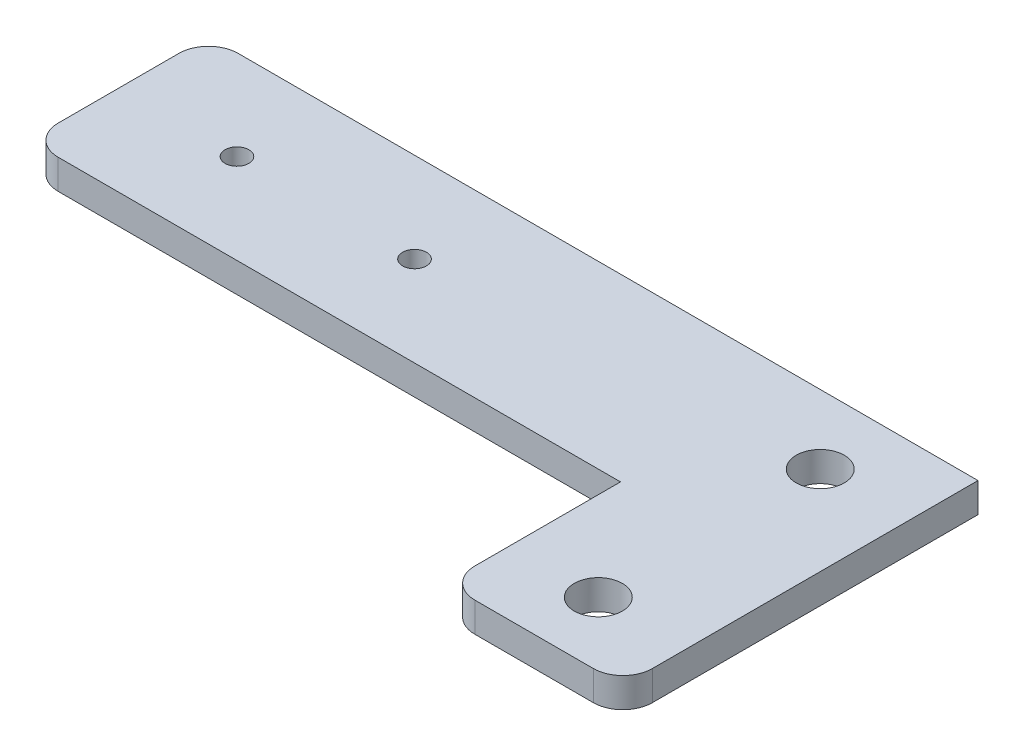
ISO-10303-21;
HEADER;
FILE_DESCRIPTION(('STEP AP214'),'2;1');
FILE_NAME('part.step','',(''),(''),'','','');
FILE_SCHEMA(('AUTOMOTIVE_DESIGN { 1 0 10303 214 1 1 1 1 }'));
ENDSEC;
DATA;
#1=APPLICATION_CONTEXT('core data for automotive mechanical design processes');
#2=APPLICATION_PROTOCOL_DEFINITION('international standard','automotive_design',2000,#1);
#3=PRODUCT_CONTEXT('',#1,'mechanical');
#4=PRODUCT('Part','Part','',(#3));
#5=PRODUCT_RELATED_PRODUCT_CATEGORY('part','',(#4));
#6=PRODUCT_DEFINITION_FORMATION('','',#4);
#7=PRODUCT_DEFINITION_CONTEXT('part definition',#1,'design');
#8=PRODUCT_DEFINITION('design','',#6,#7);
#9=PRODUCT_DEFINITION_SHAPE('','',#8);
#10=(LENGTH_UNIT() NAMED_UNIT(*) SI_UNIT(.MILLI.,.METRE.));
#11=(NAMED_UNIT(*) PLANE_ANGLE_UNIT() SI_UNIT($,.RADIAN.));
#12=(NAMED_UNIT(*) SI_UNIT($,.STERADIAN.) SOLID_ANGLE_UNIT());
#13=UNCERTAINTY_MEASURE_WITH_UNIT(LENGTH_MEASURE(1.E-05),#10,'distance_accuracy_value','');
#14=(GEOMETRIC_REPRESENTATION_CONTEXT(3) GLOBAL_UNCERTAINTY_ASSIGNED_CONTEXT((#13)) GLOBAL_UNIT_ASSIGNED_CONTEXT((#10,
#11,#12)) REPRESENTATION_CONTEXT('',''));
#15=CARTESIAN_POINT('',(0.,0.,0.));
#16=DIRECTION('',(0.,0.,1.));
#17=DIRECTION('',(1.,0.,0.));
#18=AXIS2_PLACEMENT_3D('',#15,#16,#17);
#19=CARTESIAN_POINT('',(0.,6.35,38.608));
#20=DIRECTION('',(1.,0.,0.));
#21=DIRECTION('',(0.,0.,-1.));
#22=AXIS2_PLACEMENT_3D('',#19,#20,#21);
#23=PLANE('',#22);
#24=DIRECTION('',(0.,0.,1.));
#25=VECTOR('',#24,1.);
#26=CARTESIAN_POINT('',(0.,0.,38.608));
#27=LINE('',#26,#25);
#28=CARTESIAN_POINT('',(0.,0.,6.35));
#29=VERTEX_POINT('',#28);
#30=CARTESIAN_POINT('',(0.,0.,32.258));
#31=VERTEX_POINT('',#30);
#32=EDGE_CURVE('E157',#29,#31,#27,.T.);
#33=ORIENTED_EDGE('',*,*,#32,.T.);
#34=DIRECTION('',(0.,-1.,0.));
#35=VECTOR('',#34,1.);
#36=CARTESIAN_POINT('',(0.,6.35,32.258));
#37=LINE('',#36,#35);
#38=CARTESIAN_POINT('',(0.,6.35,32.258));
#39=VERTEX_POINT('',#38);
#40=EDGE_CURVE('E48',#31,#39,#37,.F.);
#41=ORIENTED_EDGE('',*,*,#40,.T.);
#42=DIRECTION('',(0.,0.,1.));
#43=VECTOR('',#42,1.);
#44=CARTESIAN_POINT('',(0.,6.35,38.608));
#45=LINE('',#44,#43);
#46=CARTESIAN_POINT('',(0.,6.35,6.35));
#47=VERTEX_POINT('',#46);
#48=EDGE_CURVE('E131',#47,#39,#45,.T.);
#49=ORIENTED_EDGE('',*,*,#48,.F.);
#50=DIRECTION('',(0.,-1.,0.));
#51=VECTOR('',#50,1.);
#52=CARTESIAN_POINT('',(0.,6.35,6.35));
#53=LINE('',#52,#51);
#54=EDGE_CURVE('E218',#47,#29,#53,.T.);
#55=ORIENTED_EDGE('',*,*,#54,.T.);
#56=EDGE_LOOP('',(#33,#41,#49,#55));
#57=FACE_BOUND('',#56,.T.);
#58=ADVANCED_FACE('F39',(#57),#23,.F.);
#59=CARTESIAN_POINT('',(127.,6.35,38.608));
#60=DIRECTION('',(0.,0.,-1.));
#61=DIRECTION('',(-1.,0.,0.));
#62=AXIS2_PLACEMENT_3D('',#59,#60,#61);
#63=PLANE('',#62);
#64=DIRECTION('',(1.,0.,0.));
#65=VECTOR('',#64,1.);
#66=CARTESIAN_POINT('',(127.,6.35,38.608));
#67=LINE('',#66,#65);
#68=CARTESIAN_POINT('',(6.34999999999999,6.35,38.608));
#69=VERTEX_POINT('',#68);
#70=CARTESIAN_POINT('',(127.,6.35,38.608));
#71=VERTEX_POINT('',#70);
#72=EDGE_CURVE('E118',#69,#71,#67,.T.);
#73=ORIENTED_EDGE('',*,*,#72,.F.);
#74=DIRECTION('',(0.,-1.,0.));
#75=VECTOR('',#74,1.);
#76=CARTESIAN_POINT('',(6.34999999999999,6.35,38.608));
#77=LINE('',#76,#75);
#78=CARTESIAN_POINT('',(6.34999999999999,0.,38.608));
#79=VERTEX_POINT('',#78);
#80=EDGE_CURVE('E215',#69,#79,#77,.T.);
#81=ORIENTED_EDGE('',*,*,#80,.T.);
#82=DIRECTION('',(1.,0.,0.));
#83=VECTOR('',#82,1.);
#84=CARTESIAN_POINT('',(127.,0.,38.608));
#85=LINE('',#84,#83);
#86=CARTESIAN_POINT('',(127.,0.,38.608));
#87=VERTEX_POINT('',#86);
#88=EDGE_CURVE('E137',#79,#87,#85,.T.);
#89=ORIENTED_EDGE('',*,*,#88,.T.);
#90=DIRECTION('',(0.,-1.,0.));
#91=VECTOR('',#90,1.);
#92=CARTESIAN_POINT('',(127.,6.35,38.608));
#93=LINE('',#92,#91);
#94=EDGE_CURVE('E134',#71,#87,#93,.T.);
#95=ORIENTED_EDGE('',*,*,#94,.F.);
#96=EDGE_LOOP('',(#73,#81,#89,#95));
#97=FACE_BOUND('',#96,.T.);
#98=ADVANCED_FACE('F135',(#97),#63,.F.);
#99=CARTESIAN_POINT('',(127.,6.35,76.2));
#100=DIRECTION('',(1.,0.,0.));
#101=DIRECTION('',(0.,0.,-1.));
#102=AXIS2_PLACEMENT_3D('',#99,#100,#101);
#103=PLANE('',#102);
#104=DIRECTION('',(0.,0.,1.));
#105=VECTOR('',#104,1.);
#106=CARTESIAN_POINT('',(127.,0.,76.2));
#107=LINE('',#106,#105);
#108=CARTESIAN_POINT('',(127.,0.,69.85));
#109=VERTEX_POINT('',#108);
#110=EDGE_CURVE('E164',#87,#109,#107,.T.);
#111=ORIENTED_EDGE('',*,*,#110,.T.);
#112=DIRECTION('',(0.,-1.,0.));
#113=VECTOR('',#112,1.);
#114=CARTESIAN_POINT('',(127.,6.35,69.85));
#115=LINE('',#114,#113);
#116=CARTESIAN_POINT('',(127.,6.35,69.85));
#117=VERTEX_POINT('',#116);
#118=EDGE_CURVE('E61',#109,#117,#115,.F.);
#119=ORIENTED_EDGE('',*,*,#118,.T.);
#120=DIRECTION('',(0.,0.,1.));
#121=VECTOR('',#120,1.);
#122=CARTESIAN_POINT('',(127.,6.35,76.2));
#123=LINE('',#122,#121);
#124=EDGE_CURVE('E122',#71,#117,#123,.T.);
#125=ORIENTED_EDGE('',*,*,#124,.F.);
#126=ORIENTED_EDGE('',*,*,#94,.T.);
#127=EDGE_LOOP('',(#111,#119,#125,#126));
#128=FACE_BOUND('',#127,.T.);
#129=ADVANCED_FACE('F143',(#128),#103,.F.);
#130=CARTESIAN_POINT('',(165.1,6.35,76.2));
#131=DIRECTION('',(0.,0.,-1.));
#132=DIRECTION('',(-1.,0.,0.));
#133=AXIS2_PLACEMENT_3D('',#130,#131,#132);
#134=PLANE('',#133);
#135=DIRECTION('',(1.,0.,0.));
#136=VECTOR('',#135,1.);
#137=CARTESIAN_POINT('',(165.1,0.,76.2));
#138=LINE('',#137,#136);
#139=CARTESIAN_POINT('',(133.35,0.,76.2));
#140=VERTEX_POINT('',#139);
#141=CARTESIAN_POINT('',(158.75,0.,76.2));
#142=VERTEX_POINT('',#141);
#143=EDGE_CURVE('E167',#140,#142,#138,.T.);
#144=ORIENTED_EDGE('',*,*,#143,.T.);
#145=DIRECTION('',(0.,-1.,0.));
#146=VECTOR('',#145,1.);
#147=CARTESIAN_POINT('',(158.75,6.35,76.2));
#148=LINE('',#147,#146);
#149=CARTESIAN_POINT('',(158.75,6.35,76.2));
#150=VERTEX_POINT('',#149);
#151=EDGE_CURVE('E199',#142,#150,#148,.F.);
#152=ORIENTED_EDGE('',*,*,#151,.T.);
#153=DIRECTION('',(1.,0.,0.));
#154=VECTOR('',#153,1.);
#155=CARTESIAN_POINT('',(165.1,6.35,76.2));
#156=LINE('',#155,#154);
#157=CARTESIAN_POINT('',(133.35,6.35,76.2));
#158=VERTEX_POINT('',#157);
#159=EDGE_CURVE('E145',#158,#150,#156,.T.);
#160=ORIENTED_EDGE('',*,*,#159,.F.);
#161=DIRECTION('',(0.,-1.,0.));
#162=VECTOR('',#161,1.);
#163=CARTESIAN_POINT('',(133.35,6.35,76.2));
#164=LINE('',#163,#162);
#165=EDGE_CURVE('E195',#158,#140,#164,.T.);
#166=ORIENTED_EDGE('',*,*,#165,.T.);
#167=EDGE_LOOP('',(#144,#152,#160,#166));
#168=FACE_BOUND('',#167,.T.);
#169=ADVANCED_FACE('F241',(#168),#134,.F.);
#170=CARTESIAN_POINT('',(165.1,6.35,0.));
#171=DIRECTION('',(-1.,0.,0.));
#172=DIRECTION('',(0.,0.,1.));
#173=AXIS2_PLACEMENT_3D('',#170,#171,#172);
#174=PLANE('',#173);
#175=DIRECTION('',(0.,0.,-1.));
#176=VECTOR('',#175,1.);
#177=CARTESIAN_POINT('',(165.1,6.35,0.));
#178=LINE('',#177,#176);
#179=CARTESIAN_POINT('',(165.1,6.35,69.85));
#180=VERTEX_POINT('',#179);
#181=CARTESIAN_POINT('',(165.1,6.35,0.));
#182=VERTEX_POINT('',#181);
#183=EDGE_CURVE('E148',#180,#182,#178,.T.);
#184=ORIENTED_EDGE('',*,*,#183,.F.);
#185=DIRECTION('',(0.,-1.,0.));
#186=VECTOR('',#185,1.);
#187=CARTESIAN_POINT('',(165.1,6.35,69.85));
#188=LINE('',#187,#186);
#189=CARTESIAN_POINT('',(165.1,0.,69.85));
#190=VERTEX_POINT('',#189);
#191=EDGE_CURVE('E140',#180,#190,#188,.T.);
#192=ORIENTED_EDGE('',*,*,#191,.T.);
#193=DIRECTION('',(0.,0.,-1.));
#194=VECTOR('',#193,1.);
#195=CARTESIAN_POINT('',(165.1,0.,0.));
#196=LINE('',#195,#194);
#197=CARTESIAN_POINT('',(165.1,0.,0.));
#198=VERTEX_POINT('',#197);
#199=EDGE_CURVE('E171',#190,#198,#196,.T.);
#200=ORIENTED_EDGE('',*,*,#199,.T.);
#201=DIRECTION('',(0.,-1.,0.));
#202=VECTOR('',#201,1.);
#203=CARTESIAN_POINT('',(165.1,6.35,0.));
#204=LINE('',#203,#202);
#205=EDGE_CURVE('E141',#182,#198,#204,.T.);
#206=ORIENTED_EDGE('',*,*,#205,.F.);
#207=EDGE_LOOP('',(#184,#192,#200,#206));
#208=FACE_BOUND('',#207,.T.);
#209=ADVANCED_FACE('F249',(#208),#174,.F.);
#210=CARTESIAN_POINT('',(0.,6.35,0.));
#211=DIRECTION('',(0.,0.,1.));
#212=DIRECTION('',(1.,0.,0.));
#213=AXIS2_PLACEMENT_3D('',#210,#211,#212);
#214=PLANE('',#213);
#215=DIRECTION('',(-1.,0.,0.));
#216=VECTOR('',#215,1.);
#217=CARTESIAN_POINT('',(0.,0.,0.));
#218=LINE('',#217,#216);
#219=CARTESIAN_POINT('',(6.35,0.,0.));
#220=VERTEX_POINT('',#219);
#221=EDGE_CURVE('E174',#198,#220,#218,.T.);
#222=ORIENTED_EDGE('',*,*,#221,.T.);
#223=DIRECTION('',(0.,-1.,0.));
#224=VECTOR('',#223,1.);
#225=CARTESIAN_POINT('',(6.35,6.35,0.));
#226=LINE('',#225,#224);
#227=CARTESIAN_POINT('',(6.35,6.35,0.));
#228=VERTEX_POINT('',#227);
#229=EDGE_CURVE('E11',#220,#228,#226,.F.);
#230=ORIENTED_EDGE('',*,*,#229,.T.);
#231=DIRECTION('',(-1.,0.,0.));
#232=VECTOR('',#231,1.);
#233=CARTESIAN_POINT('',(0.,6.35,0.));
#234=LINE('',#233,#232);
#235=EDGE_CURVE('E154',#182,#228,#234,.T.);
#236=ORIENTED_EDGE('',*,*,#235,.F.);
#237=ORIENTED_EDGE('',*,*,#205,.T.);
#238=EDGE_LOOP('',(#222,#230,#236,#237));
#239=FACE_BOUND('',#238,.T.);
#240=ADVANCED_FACE('F251',(#239),#214,.F.);
#241=CARTESIAN_POINT('',(0.,6.35,0.));
#242=DIRECTION('',(0.,-1.,0.));
#243=DIRECTION('',(0.,0.,-1.));
#244=AXIS2_PLACEMENT_3D('',#241,#242,#243);
#245=PLANE('',#244);
#246=CARTESIAN_POINT('',(25.4,6.35,19.304));
#247=DIRECTION('',(0.,1.,0.));
#248=DIRECTION('',(0.,0.,1.));
#249=AXIS2_PLACEMENT_3D('',#246,#247,#248);
#250=CIRCLE('',#249,2.5527);
#251=CARTESIAN_POINT('',(25.4,6.35,21.8567));
#252=VERTEX_POINT('',#251);
#253=EDGE_CURVE('E161',#252,#252,#250,.T.);
#254=ORIENTED_EDGE('',*,*,#253,.F.);
#255=EDGE_LOOP('',(#254));
#256=FACE_BOUND('',#255,.T.);
#257=CARTESIAN_POINT('',(146.05,6.35,14.7955));
#258=DIRECTION('',(0.,1.,0.));
#259=DIRECTION('',(0.,0.,1.));
#260=AXIS2_PLACEMENT_3D('',#257,#258,#259);
#261=CIRCLE('',#260,5.1562);
#262=CARTESIAN_POINT('',(146.05,6.35,19.9517));
#263=VERTEX_POINT('',#262);
#264=EDGE_CURVE('E395',#263,#263,#261,.T.);
#265=ORIENTED_EDGE('',*,*,#264,.F.);
#266=EDGE_LOOP('',(#265));
#267=FACE_BOUND('',#266,.T.);
#268=CARTESIAN_POINT('',(146.05,6.35,62.4205));
#269=DIRECTION('',(0.,1.,0.));
#270=DIRECTION('',(0.,0.,1.));
#271=AXIS2_PLACEMENT_3D('',#268,#269,#270);
#272=CIRCLE('',#271,5.1562);
#273=CARTESIAN_POINT('',(146.05,6.35,67.5767));
#274=VERTEX_POINT('',#273);
#275=EDGE_CURVE('E399',#274,#274,#272,.T.);
#276=ORIENTED_EDGE('',*,*,#275,.F.);
#277=EDGE_LOOP('',(#276));
#278=FACE_BOUND('',#277,.T.);
#279=CARTESIAN_POINT('',(63.5,6.35,19.304));
#280=DIRECTION('',(0.,1.,0.));
#281=DIRECTION('',(0.,0.,1.));
#282=AXIS2_PLACEMENT_3D('',#279,#280,#281);
#283=CIRCLE('',#282,2.55270000000001);
#284=CARTESIAN_POINT('',(63.5,6.35,21.8567));
#285=VERTEX_POINT('',#284);
#286=EDGE_CURVE('E402',#285,#285,#283,.T.);
#287=ORIENTED_EDGE('',*,*,#286,.F.);
#288=EDGE_LOOP('',(#287));
#289=FACE_BOUND('',#288,.T.);
#290=ORIENTED_EDGE('',*,*,#159,.T.);
#291=CARTESIAN_POINT('',(158.75,6.35,69.85));
#292=DIRECTION('',(0.,-1.,0.));
#293=DIRECTION('',(0.,0.,-1.));
#294=AXIS2_PLACEMENT_3D('',#291,#292,#293);
#295=CIRCLE('',#294,6.35);
#296=EDGE_CURVE('E210',#150,#180,#295,.F.);
#297=ORIENTED_EDGE('',*,*,#296,.T.);
#298=ORIENTED_EDGE('',*,*,#183,.T.);
#299=ORIENTED_EDGE('',*,*,#235,.T.);
#300=CARTESIAN_POINT('',(6.35,6.35,6.35));
#301=DIRECTION('',(0.,-1.,0.));
#302=DIRECTION('',(0.,0.,-1.));
#303=AXIS2_PLACEMENT_3D('',#300,#301,#302);
#304=CIRCLE('',#303,6.35);
#305=EDGE_CURVE('E202',#228,#47,#304,.F.);
#306=ORIENTED_EDGE('',*,*,#305,.T.);
#307=ORIENTED_EDGE('',*,*,#48,.T.);
#308=CARTESIAN_POINT('',(6.34999999999999,6.35,32.258));
#309=DIRECTION('',(0.,-1.,0.));
#310=DIRECTION('',(0.,0.,-1.));
#311=AXIS2_PLACEMENT_3D('',#308,#309,#310);
#312=CIRCLE('',#311,6.35);
#313=EDGE_CURVE('E126',#39,#69,#312,.F.);
#314=ORIENTED_EDGE('',*,*,#313,.T.);
#315=ORIENTED_EDGE('',*,*,#72,.T.);
#316=ORIENTED_EDGE('',*,*,#124,.T.);
#317=CARTESIAN_POINT('',(133.35,6.35,69.85));
#318=DIRECTION('',(0.,-1.,0.));
#319=DIRECTION('',(0.,0.,-1.));
#320=AXIS2_PLACEMENT_3D('',#317,#318,#319);
#321=CIRCLE('',#320,6.35);
#322=EDGE_CURVE('E207',#117,#158,#321,.F.);
#323=ORIENTED_EDGE('',*,*,#322,.T.);
#324=EDGE_LOOP('',(#290,#297,#298,#299,#306,#307,#314,#315,#316,#323));
#325=FACE_BOUND('',#324,.T.);
#326=ADVANCED_FACE('F121',(#256,#267,#278,#289,#325),#245,.F.);
#327=CARTESIAN_POINT('',(0.,0.,0.));
#328=DIRECTION('',(0.,-1.,0.));
#329=DIRECTION('',(0.,0.,-1.));
#330=AXIS2_PLACEMENT_3D('',#327,#328,#329);
#331=PLANE('',#330);
#332=CARTESIAN_POINT('',(25.4,0.,19.304));
#333=DIRECTION('',(0.,-1.,0.));
#334=DIRECTION('',(0.,0.,-1.));
#335=AXIS2_PLACEMENT_3D('',#332,#333,#334);
#336=CIRCLE('',#335,2.5527);
#337=CARTESIAN_POINT('',(25.4,0.,16.7513));
#338=VERTEX_POINT('',#337);
#339=EDGE_CURVE('E405',#338,#338,#336,.F.);
#340=ORIENTED_EDGE('',*,*,#339,.T.);
#341=EDGE_LOOP('',(#340));
#342=FACE_BOUND('',#341,.T.);
#343=CARTESIAN_POINT('',(146.05,0.,14.7955));
#344=DIRECTION('',(0.,-1.,0.));
#345=DIRECTION('',(0.,0.,-1.));
#346=AXIS2_PLACEMENT_3D('',#343,#344,#345);
#347=CIRCLE('',#346,5.1562);
#348=CARTESIAN_POINT('',(146.05,0.,9.6393));
#349=VERTEX_POINT('',#348);
#350=EDGE_CURVE('E415',#349,#349,#347,.F.);
#351=ORIENTED_EDGE('',*,*,#350,.T.);
#352=EDGE_LOOP('',(#351));
#353=FACE_BOUND('',#352,.T.);
#354=CARTESIAN_POINT('',(146.05,0.,62.4205));
#355=DIRECTION('',(0.,-1.,0.));
#356=DIRECTION('',(0.,0.,-1.));
#357=AXIS2_PLACEMENT_3D('',#354,#355,#356);
#358=CIRCLE('',#357,5.1562);
#359=CARTESIAN_POINT('',(146.05,0.,57.2643));
#360=VERTEX_POINT('',#359);
#361=EDGE_CURVE('E420',#360,#360,#358,.F.);
#362=ORIENTED_EDGE('',*,*,#361,.T.);
#363=EDGE_LOOP('',(#362));
#364=FACE_BOUND('',#363,.T.);
#365=CARTESIAN_POINT('',(63.5,0.,19.304));
#366=DIRECTION('',(0.,-1.,0.));
#367=DIRECTION('',(0.,0.,-1.));
#368=AXIS2_PLACEMENT_3D('',#365,#366,#367);
#369=CIRCLE('',#368,2.55270000000001);
#370=CARTESIAN_POINT('',(63.5,0.,16.7513));
#371=VERTEX_POINT('',#370);
#372=EDGE_CURVE('E406',#371,#371,#369,.F.);
#373=ORIENTED_EDGE('',*,*,#372,.T.);
#374=EDGE_LOOP('',(#373));
#375=FACE_BOUND('',#374,.T.);
#376=ORIENTED_EDGE('',*,*,#199,.F.);
#377=CARTESIAN_POINT('',(158.75,0.,69.85));
#378=DIRECTION('',(0.,-1.,0.));
#379=DIRECTION('',(0.,0.,-1.));
#380=AXIS2_PLACEMENT_3D('',#377,#378,#379);
#381=CIRCLE('',#380,6.35);
#382=EDGE_CURVE('E192',#190,#142,#381,.T.);
#383=ORIENTED_EDGE('',*,*,#382,.T.);
#384=ORIENTED_EDGE('',*,*,#143,.F.);
#385=CARTESIAN_POINT('',(133.35,0.,69.85));
#386=DIRECTION('',(0.,-1.,0.));
#387=DIRECTION('',(0.,0.,-1.));
#388=AXIS2_PLACEMENT_3D('',#385,#386,#387);
#389=CIRCLE('',#388,6.35);
#390=EDGE_CURVE('E189',#140,#109,#389,.T.);
#391=ORIENTED_EDGE('',*,*,#390,.T.);
#392=ORIENTED_EDGE('',*,*,#110,.F.);
#393=ORIENTED_EDGE('',*,*,#88,.F.);
#394=CARTESIAN_POINT('',(6.34999999999999,0.,32.258));
#395=DIRECTION('',(0.,-1.,0.));
#396=DIRECTION('',(0.,0.,-1.));
#397=AXIS2_PLACEMENT_3D('',#394,#395,#396);
#398=CIRCLE('',#397,6.35);
#399=EDGE_CURVE('E186',#79,#31,#398,.T.);
#400=ORIENTED_EDGE('',*,*,#399,.T.);
#401=ORIENTED_EDGE('',*,*,#32,.F.);
#402=CARTESIAN_POINT('',(6.35,0.,6.35));
#403=DIRECTION('',(0.,-1.,0.));
#404=DIRECTION('',(0.,0.,-1.));
#405=AXIS2_PLACEMENT_3D('',#402,#403,#404);
#406=CIRCLE('',#405,6.35);
#407=EDGE_CURVE('E183',#29,#220,#406,.T.);
#408=ORIENTED_EDGE('',*,*,#407,.T.);
#409=ORIENTED_EDGE('',*,*,#221,.F.);
#410=EDGE_LOOP('',(#376,#383,#384,#391,#392,#393,#400,#401,#408,#409));
#411=FACE_BOUND('',#410,.T.);
#412=ADVANCED_FACE('F233',(#342,#353,#364,#375,#411),#331,.T.);
#413=CARTESIAN_POINT('',(63.5,-0.00100000000000013,19.304));
#414=DIRECTION('',(0.,1.,0.));
#415=DIRECTION('',(0.,0.,1.));
#416=AXIS2_PLACEMENT_3D('',#413,#414,#415);
#417=CYLINDRICAL_SURFACE('',#416,2.55270000000001);
#418=ORIENTED_EDGE('',*,*,#372,.F.);
#419=EDGE_LOOP('',(#418));
#420=FACE_BOUND('',#419,.T.);
#421=ORIENTED_EDGE('',*,*,#286,.T.);
#422=EDGE_LOOP('',(#421));
#423=FACE_BOUND('',#422,.T.);
#424=ADVANCED_FACE('F316',(#420,#423),#417,.F.);
#425=CARTESIAN_POINT('',(146.05,-0.00100000000000013,62.4205));
#426=DIRECTION('',(0.,1.,0.));
#427=DIRECTION('',(0.,0.,1.));
#428=AXIS2_PLACEMENT_3D('',#425,#426,#427);
#429=CYLINDRICAL_SURFACE('',#428,5.1562);
#430=ORIENTED_EDGE('',*,*,#361,.F.);
#431=EDGE_LOOP('',(#430));
#432=FACE_BOUND('',#431,.T.);
#433=ORIENTED_EDGE('',*,*,#275,.T.);
#434=EDGE_LOOP('',(#433));
#435=FACE_BOUND('',#434,.T.);
#436=ADVANCED_FACE('F307',(#432,#435),#429,.F.);
#437=CARTESIAN_POINT('',(146.05,-0.00100000000000013,14.7955));
#438=DIRECTION('',(0.,1.,0.));
#439=DIRECTION('',(0.,0.,1.));
#440=AXIS2_PLACEMENT_3D('',#437,#438,#439);
#441=CYLINDRICAL_SURFACE('',#440,5.1562);
#442=ORIENTED_EDGE('',*,*,#350,.F.);
#443=EDGE_LOOP('',(#442));
#444=FACE_BOUND('',#443,.T.);
#445=ORIENTED_EDGE('',*,*,#264,.T.);
#446=EDGE_LOOP('',(#445));
#447=FACE_BOUND('',#446,.T.);
#448=ADVANCED_FACE('F298',(#444,#447),#441,.F.);
#449=CARTESIAN_POINT('',(25.4,-0.00100000000000013,19.304));
#450=DIRECTION('',(0.,1.,0.));
#451=DIRECTION('',(0.,0.,1.));
#452=AXIS2_PLACEMENT_3D('',#449,#450,#451);
#453=CYLINDRICAL_SURFACE('',#452,2.5527);
#454=ORIENTED_EDGE('',*,*,#339,.F.);
#455=EDGE_LOOP('',(#454));
#456=FACE_BOUND('',#455,.T.);
#457=ORIENTED_EDGE('',*,*,#253,.T.);
#458=EDGE_LOOP('',(#457));
#459=FACE_BOUND('',#458,.T.);
#460=ADVANCED_FACE('F267',(#456,#459),#453,.F.);
#461=CARTESIAN_POINT('',(158.75,6.35,69.85));
#462=DIRECTION('',(0.,-1.,0.));
#463=DIRECTION('',(0.,0.,-1.));
#464=AXIS2_PLACEMENT_3D('',#461,#462,#463);
#465=CYLINDRICAL_SURFACE('',#464,6.35);
#466=ORIENTED_EDGE('',*,*,#296,.F.);
#467=ORIENTED_EDGE('',*,*,#151,.F.);
#468=ORIENTED_EDGE('',*,*,#382,.F.);
#469=ORIENTED_EDGE('',*,*,#191,.F.);
#470=EDGE_LOOP('',(#466,#467,#468,#469));
#471=FACE_BOUND('',#470,.T.);
#472=ADVANCED_FACE('F244',(#471),#465,.T.);
#473=CARTESIAN_POINT('',(133.35,6.35,69.85));
#474=DIRECTION('',(0.,-1.,0.));
#475=DIRECTION('',(0.,0.,-1.));
#476=AXIS2_PLACEMENT_3D('',#473,#474,#475);
#477=CYLINDRICAL_SURFACE('',#476,6.35);
#478=ORIENTED_EDGE('',*,*,#322,.F.);
#479=ORIENTED_EDGE('',*,*,#118,.F.);
#480=ORIENTED_EDGE('',*,*,#390,.F.);
#481=ORIENTED_EDGE('',*,*,#165,.F.);
#482=EDGE_LOOP('',(#478,#479,#480,#481));
#483=FACE_BOUND('',#482,.T.);
#484=ADVANCED_FACE('F236',(#483),#477,.T.);
#485=CARTESIAN_POINT('',(6.34999999999999,6.35,32.258));
#486=DIRECTION('',(0.,-1.,0.));
#487=DIRECTION('',(0.,0.,-1.));
#488=AXIS2_PLACEMENT_3D('',#485,#486,#487);
#489=CYLINDRICAL_SURFACE('',#488,6.35);
#490=ORIENTED_EDGE('',*,*,#313,.F.);
#491=ORIENTED_EDGE('',*,*,#40,.F.);
#492=ORIENTED_EDGE('',*,*,#399,.F.);
#493=ORIENTED_EDGE('',*,*,#80,.F.);
#494=EDGE_LOOP('',(#490,#491,#492,#493));
#495=FACE_BOUND('',#494,.T.);
#496=ADVANCED_FACE('F230',(#495),#489,.T.);
#497=CARTESIAN_POINT('',(6.35,6.35,6.35));
#498=DIRECTION('',(0.,-1.,0.));
#499=DIRECTION('',(0.,0.,-1.));
#500=AXIS2_PLACEMENT_3D('',#497,#498,#499);
#501=CYLINDRICAL_SURFACE('',#500,6.35);
#502=ORIENTED_EDGE('',*,*,#305,.F.);
#503=ORIENTED_EDGE('',*,*,#229,.F.);
#504=ORIENTED_EDGE('',*,*,#407,.F.);
#505=ORIENTED_EDGE('',*,*,#54,.F.);
#506=EDGE_LOOP('',(#502,#503,#504,#505));
#507=FACE_BOUND('',#506,.T.);
#508=ADVANCED_FACE('F41',(#507),#501,.T.);
#509=CLOSED_SHELL('',(#58,#98,#129,#169,#209,#240,#326,#412,#424,#436,#448,#460,#472,#484,#496,#508));
#510=MANIFOLD_SOLID_BREP('B2',#509);
#511=ADVANCED_BREP_SHAPE_REPRESENTATION('',(#18,#510),#14);
#512=SHAPE_DEFINITION_REPRESENTATION(#9,#511);
ENDSEC;
END-ISO-10303-21;
